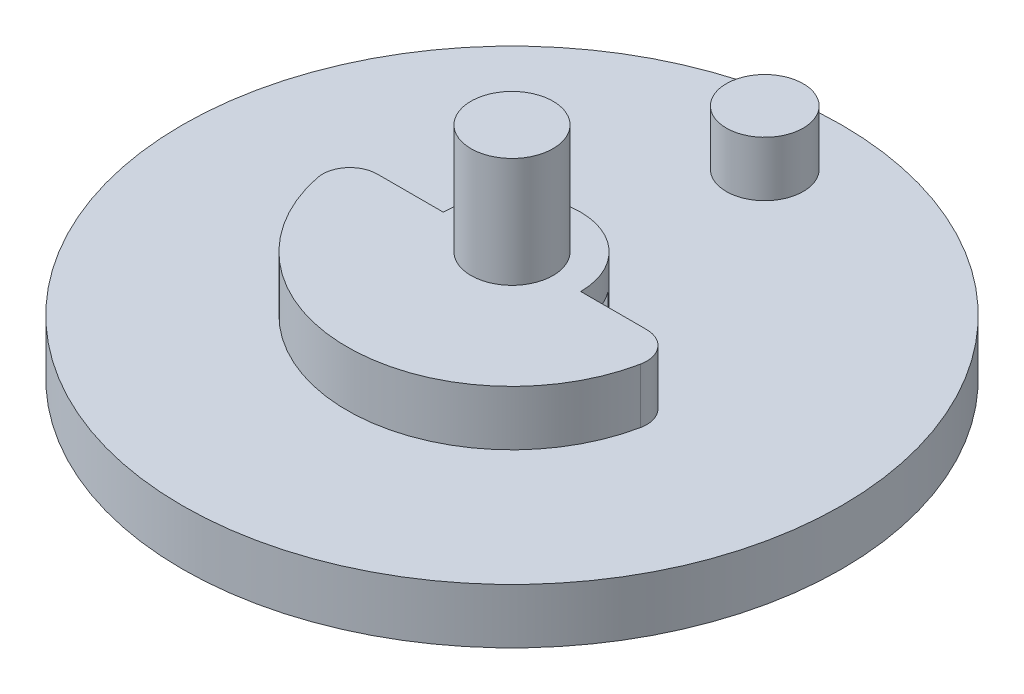
ISO-10303-21;
HEADER;
FILE_DESCRIPTION(('STEP AP214'),'2;1');
FILE_NAME('part.step','',(''),(''),'','','');
FILE_SCHEMA(('AUTOMOTIVE_DESIGN { 1 0 10303 214 1 1 1 1 }'));
ENDSEC;
DATA;
#1=APPLICATION_CONTEXT('core data for automotive mechanical design processes');
#2=APPLICATION_PROTOCOL_DEFINITION('international standard','automotive_design',2000,#1);
#3=PRODUCT_CONTEXT('',#1,'mechanical');
#4=PRODUCT('Part','Part','',(#3));
#5=PRODUCT_RELATED_PRODUCT_CATEGORY('part','',(#4));
#6=PRODUCT_DEFINITION_FORMATION('','',#4);
#7=PRODUCT_DEFINITION_CONTEXT('part definition',#1,'design');
#8=PRODUCT_DEFINITION('design','',#6,#7);
#9=PRODUCT_DEFINITION_SHAPE('','',#8);
#10=(LENGTH_UNIT() NAMED_UNIT(*) SI_UNIT(.MILLI.,.METRE.));
#11=(NAMED_UNIT(*) PLANE_ANGLE_UNIT() SI_UNIT($,.RADIAN.));
#12=(NAMED_UNIT(*) SI_UNIT($,.STERADIAN.) SOLID_ANGLE_UNIT());
#13=UNCERTAINTY_MEASURE_WITH_UNIT(LENGTH_MEASURE(1.E-05),#10,'distance_accuracy_value','');
#14=(GEOMETRIC_REPRESENTATION_CONTEXT(3) GLOBAL_UNCERTAINTY_ASSIGNED_CONTEXT((#13)) GLOBAL_UNIT_ASSIGNED_CONTEXT((#10,
#11,#12)) REPRESENTATION_CONTEXT('',''));
#15=CARTESIAN_POINT('',(0.,0.,0.));
#16=DIRECTION('',(0.,0.,1.));
#17=DIRECTION('',(1.,0.,0.));
#18=AXIS2_PLACEMENT_3D('',#15,#16,#17);
#19=CARTESIAN_POINT('',(0.,-5.,0.));
#20=DIRECTION('',(0.,1.,0.));
#21=DIRECTION('',(0.,0.,1.));
#22=AXIS2_PLACEMENT_3D('',#19,#20,#21);
#23=CYLINDRICAL_SURFACE('',#22,4.);
#24=CARTESIAN_POINT('',(0.,0.,0.));
#25=DIRECTION('',(0.,-1.,0.));
#26=DIRECTION('',(0.,0.,-1.));
#27=AXIS2_PLACEMENT_3D('',#24,#25,#26);
#28=CIRCLE('',#27,4.);
#29=CARTESIAN_POINT('',(0.,0.,-4.));
#30=VERTEX_POINT('',#29);
#31=EDGE_CURVE('E239',#30,#30,#28,.T.);
#32=ORIENTED_EDGE('',*,*,#31,.T.);
#33=EDGE_LOOP('',(#32));
#34=FACE_BOUND('',#33,.T.);
#35=CARTESIAN_POINT('',(0.,-2.5,0.));
#36=DIRECTION('',(0.,-1.,0.));
#37=DIRECTION('',(0.,0.,-1.));
#38=AXIS2_PLACEMENT_3D('',#35,#36,#37);
#39=CIRCLE('',#38,4.);
#40=CARTESIAN_POINT('',(0.,-2.5,-4.));
#41=VERTEX_POINT('',#40);
#42=EDGE_CURVE('E207',#41,#41,#39,.T.);
#43=ORIENTED_EDGE('',*,*,#42,.F.);
#44=EDGE_LOOP('',(#43));
#45=FACE_BOUND('',#44,.T.);
#46=ADVANCED_FACE('F40',(#34,#45),#23,.T.);
#47=CARTESIAN_POINT('',(0.,2.,0.));
#48=DIRECTION('',(0.,1.,0.));
#49=DIRECTION('',(0.,0.,1.));
#50=AXIS2_PLACEMENT_3D('',#47,#48,#49);
#51=PLANE('',#50);
#52=DIRECTION('',(-1.,0.,0.));
#53=VECTOR('',#52,1.);
#54=CARTESIAN_POINT('',(-6.,2.,0.));
#55=LINE('',#54,#53);
#56=CARTESIAN_POINT('',(-2.5,2.,0.));
#57=VERTEX_POINT('',#56);
#58=CARTESIAN_POINT('',(-4.89897948556636,2.,0.));
#59=VERTEX_POINT('',#58);
#60=EDGE_CURVE('E275',#57,#59,#55,.T.);
#61=ORIENTED_EDGE('',*,*,#60,.F.);
#62=CARTESIAN_POINT('',(0.,2.,0.));
#63=DIRECTION('',(0.,1.,0.));
#64=DIRECTION('',(0.,0.,1.));
#65=AXIS2_PLACEMENT_3D('',#62,#63,#64);
#66=CIRCLE('',#65,2.5);
#67=CARTESIAN_POINT('',(-2.,2.,-1.5));
#68=VERTEX_POINT('',#67);
#69=EDGE_CURVE('E182',#68,#57,#66,.T.);
#70=ORIENTED_EDGE('',*,*,#69,.F.);
#71=CARTESIAN_POINT('',(2.,2.,-1.5));
#72=VERTEX_POINT('',#71);
#73=EDGE_CURVE('E55',#72,#68,#66,.T.);
#74=ORIENTED_EDGE('',*,*,#73,.F.);
#75=CARTESIAN_POINT('',(2.5,2.,0.));
#76=VERTEX_POINT('',#75);
#77=EDGE_CURVE('E179',#76,#72,#66,.T.);
#78=ORIENTED_EDGE('',*,*,#77,.F.);
#79=CARTESIAN_POINT('',(4.89897948556635,2.,0.));
#80=VERTEX_POINT('',#79);
#81=EDGE_CURVE('E270',#80,#76,#55,.T.);
#82=ORIENTED_EDGE('',*,*,#81,.F.);
#83=CARTESIAN_POINT('',(4.89897948556636,2.,1.));
#84=DIRECTION('',(0.,1.,0.));
#85=DIRECTION('',(0.,0.,1.));
#86=AXIS2_PLACEMENT_3D('',#83,#84,#85);
#87=CIRCLE('',#86,1.);
#88=CARTESIAN_POINT('',(5.87877538267963,2.,1.2));
#89=VERTEX_POINT('',#88);
#90=EDGE_CURVE('E295',#80,#89,#87,.F.);
#91=ORIENTED_EDGE('',*,*,#90,.T.);
#92=CARTESIAN_POINT('',(0.,2.,0.));
#93=DIRECTION('',(0.,1.,0.));
#94=DIRECTION('',(0.,0.,1.));
#95=AXIS2_PLACEMENT_3D('',#92,#93,#94);
#96=CIRCLE('',#95,6.);
#97=CARTESIAN_POINT('',(-5.87877538267963,2.,1.2));
#98=VERTEX_POINT('',#97);
#99=EDGE_CURVE('E266',#98,#89,#96,.T.);
#100=ORIENTED_EDGE('',*,*,#99,.F.);
#101=CARTESIAN_POINT('',(-4.89897948556636,2.,1.));
#102=DIRECTION('',(0.,1.,0.));
#103=DIRECTION('',(0.,0.,1.));
#104=AXIS2_PLACEMENT_3D('',#101,#102,#103);
#105=CIRCLE('',#104,1.);
#106=EDGE_CURVE('E242',#98,#59,#105,.F.);
#107=ORIENTED_EDGE('',*,*,#106,.T.);
#108=EDGE_LOOP('',(#61,#70,#74,#78,#82,#91,#100,#107));
#109=FACE_BOUND('',#108,.T.);
#110=CARTESIAN_POINT('',(0.,2.,0.));
#111=DIRECTION('',(0.,1.,0.));
#112=DIRECTION('',(0.,0.,1.));
#113=AXIS2_PLACEMENT_3D('',#110,#111,#112);
#114=CIRCLE('',#113,12.);
#115=CARTESIAN_POINT('',(0.,2.,12.));
#116=VERTEX_POINT('',#115);
#117=EDGE_CURVE('E277',#116,#116,#114,.T.);
#118=ORIENTED_EDGE('',*,*,#117,.T.);
#119=EDGE_LOOP('',(#118));
#120=FACE_BOUND('',#119,.T.);
#121=CARTESIAN_POINT('',(0.,2.,-9.2));
#122=DIRECTION('',(0.,1.,0.));
#123=DIRECTION('',(0.,0.,1.));
#124=AXIS2_PLACEMENT_3D('',#121,#122,#123);
#125=CIRCLE('',#124,1.4);
#126=CARTESIAN_POINT('',(0.,2.,-7.8));
#127=VERTEX_POINT('',#126);
#128=EDGE_CURVE('E262',#127,#127,#125,.T.);
#129=ORIENTED_EDGE('',*,*,#128,.F.);
#130=EDGE_LOOP('',(#129));
#131=FACE_BOUND('',#130,.T.);
#132=ADVANCED_FACE('F317',(#109,#120,#131),#51,.T.);
#133=CARTESIAN_POINT('',(-6.,4.,0.));
#134=DIRECTION('',(0.,0.,1.));
#135=DIRECTION('',(1.,0.,0.));
#136=AXIS2_PLACEMENT_3D('',#133,#134,#135);
#137=PLANE('',#136);
#138=ORIENTED_EDGE('',*,*,#60,.T.);
#139=DIRECTION('',(0.,-1.,0.));
#140=VECTOR('',#139,1.);
#141=CARTESIAN_POINT('',(-4.89897948556636,4.,0.));
#142=LINE('',#141,#140);
#143=CARTESIAN_POINT('',(-4.89897948556636,4.,0.));
#144=VERTEX_POINT('',#143);
#145=EDGE_CURVE('E158',#59,#144,#142,.F.);
#146=ORIENTED_EDGE('',*,*,#145,.T.);
#147=DIRECTION('',(-1.,0.,0.));
#148=VECTOR('',#147,1.);
#149=CARTESIAN_POINT('',(-6.,4.,0.));
#150=LINE('',#149,#148);
#151=CARTESIAN_POINT('',(-2.5,4.,0.));
#152=VERTEX_POINT('',#151);
#153=EDGE_CURVE('E150',#152,#144,#150,.T.);
#154=ORIENTED_EDGE('',*,*,#153,.F.);
#155=DIRECTION('',(0.,1.,0.));
#156=VECTOR('',#155,1.);
#157=CARTESIAN_POINT('',(-2.5,-10.0981376159078,0.));
#158=LINE('',#157,#156);
#159=CARTESIAN_POINT('',(-2.5,3.,0.));
#160=VERTEX_POINT('',#159);
#161=EDGE_CURVE('E155',#160,#152,#158,.T.);
#162=ORIENTED_EDGE('',*,*,#161,.F.);
#163=EDGE_CURVE('E170',#57,#160,#158,.T.);
#164=ORIENTED_EDGE('',*,*,#163,.F.);
#165=EDGE_LOOP('',(#138,#146,#154,#162,#164));
#166=FACE_BOUND('',#165,.T.);
#167=ADVANCED_FACE('F153',(#166),#137,.F.);
#168=CARTESIAN_POINT('',(4.89897948556635,4.,0.));
#169=VERTEX_POINT('',#168);
#170=CARTESIAN_POINT('',(2.5,4.,0.));
#171=VERTEX_POINT('',#170);
#172=EDGE_CURVE('E162',#169,#171,#150,.T.);
#173=ORIENTED_EDGE('',*,*,#172,.F.);
#174=DIRECTION('',(0.,-1.,0.));
#175=VECTOR('',#174,1.);
#176=CARTESIAN_POINT('',(4.89897948556636,4.,0.));
#177=LINE('',#176,#175);
#178=EDGE_CURVE('E280',#169,#80,#177,.T.);
#179=ORIENTED_EDGE('',*,*,#178,.T.);
#180=ORIENTED_EDGE('',*,*,#81,.T.);
#181=DIRECTION('',(0.,1.,0.));
#182=VECTOR('',#181,1.);
#183=CARTESIAN_POINT('',(2.5,-10.0981376159078,0.));
#184=LINE('',#183,#182);
#185=CARTESIAN_POINT('',(2.5,3.,0.));
#186=VERTEX_POINT('',#185);
#187=EDGE_CURVE('E180',#76,#186,#184,.T.);
#188=ORIENTED_EDGE('',*,*,#187,.T.);
#189=EDGE_CURVE('E183',#186,#171,#184,.T.);
#190=ORIENTED_EDGE('',*,*,#189,.T.);
#191=EDGE_LOOP('',(#173,#179,#180,#188,#190));
#192=FACE_BOUND('',#191,.T.);
#193=ADVANCED_FACE('F365',(#192),#137,.F.);
#194=CARTESIAN_POINT('',(0.,2.,0.));
#195=DIRECTION('',(0.,-1.,0.));
#196=DIRECTION('',(0.,0.,-1.));
#197=AXIS2_PLACEMENT_3D('',#194,#195,#196);
#198=CYLINDRICAL_SURFACE('',#197,12.);
#199=ORIENTED_EDGE('',*,*,#117,.F.);
#200=EDGE_LOOP('',(#199));
#201=FACE_BOUND('',#200,.T.);
#202=CARTESIAN_POINT('',(0.,0.,0.));
#203=DIRECTION('',(0.,1.,0.));
#204=DIRECTION('',(0.,0.,1.));
#205=AXIS2_PLACEMENT_3D('',#202,#203,#204);
#206=CIRCLE('',#205,12.);
#207=CARTESIAN_POINT('',(0.,0.,12.));
#208=VERTEX_POINT('',#207);
#209=EDGE_CURVE('E272',#208,#208,#206,.T.);
#210=ORIENTED_EDGE('',*,*,#209,.T.);
#211=EDGE_LOOP('',(#210));
#212=FACE_BOUND('',#211,.T.);
#213=ADVANCED_FACE('F372',(#201,#212),#198,.T.);
#214=CARTESIAN_POINT('',(0.,0.,0.));
#215=DIRECTION('',(0.,1.,0.));
#216=DIRECTION('',(0.,0.,1.));
#217=AXIS2_PLACEMENT_3D('',#214,#215,#216);
#218=PLANE('',#217);
#219=ORIENTED_EDGE('',*,*,#31,.F.);
#220=EDGE_LOOP('',(#219));
#221=FACE_BOUND('',#220,.T.);
#222=ORIENTED_EDGE('',*,*,#209,.F.);
#223=EDGE_LOOP('',(#222));
#224=FACE_BOUND('',#223,.T.);
#225=ADVANCED_FACE('F367',(#221,#224),#218,.F.);
#226=CARTESIAN_POINT('',(0.,4.,0.));
#227=DIRECTION('',(0.,-1.,0.));
#228=DIRECTION('',(0.,0.,-1.));
#229=AXIS2_PLACEMENT_3D('',#226,#227,#228);
#230=CYLINDRICAL_SURFACE('',#229,6.);
#231=ORIENTED_EDGE('',*,*,#99,.T.);
#232=DIRECTION('',(0.,-1.,0.));
#233=VECTOR('',#232,1.);
#234=CARTESIAN_POINT('',(5.87877538267963,4.,1.2));
#235=LINE('',#234,#233);
#236=CARTESIAN_POINT('',(5.87877538267963,4.,1.2));
#237=VERTEX_POINT('',#236);
#238=EDGE_CURVE('E288',#89,#237,#235,.F.);
#239=ORIENTED_EDGE('',*,*,#238,.T.);
#240=CARTESIAN_POINT('',(0.,4.,0.));
#241=DIRECTION('',(0.,1.,0.));
#242=DIRECTION('',(0.,0.,1.));
#243=AXIS2_PLACEMENT_3D('',#240,#241,#242);
#244=CIRCLE('',#243,6.);
#245=CARTESIAN_POINT('',(-5.87877538267963,4.,1.2));
#246=VERTEX_POINT('',#245);
#247=EDGE_CURVE('E163',#246,#237,#244,.T.);
#248=ORIENTED_EDGE('',*,*,#247,.F.);
#249=DIRECTION('',(0.,-1.,0.));
#250=VECTOR('',#249,1.);
#251=CARTESIAN_POINT('',(-5.87877538267963,4.,1.2));
#252=LINE('',#251,#250);
#253=EDGE_CURVE('E285',#246,#98,#252,.T.);
#254=ORIENTED_EDGE('',*,*,#253,.T.);
#255=EDGE_LOOP('',(#231,#239,#248,#254));
#256=FACE_BOUND('',#255,.T.);
#257=ADVANCED_FACE('F362',(#256),#230,.T.);
#258=CARTESIAN_POINT('',(0.,4.,0.));
#259=DIRECTION('',(0.,1.,0.));
#260=DIRECTION('',(0.,0.,1.));
#261=AXIS2_PLACEMENT_3D('',#258,#259,#260);
#262=PLANE('',#261);
#263=ORIENTED_EDGE('',*,*,#172,.T.);
#264=CARTESIAN_POINT('',(0.,4.,0.));
#265=DIRECTION('',(0.,-1.,0.));
#266=DIRECTION('',(0.,0.,1.));
#267=AXIS2_PLACEMENT_3D('',#264,#265,#266);
#268=CIRCLE('',#267,2.5);
#269=EDGE_CURVE('E167',#152,#171,#268,.T.);
#270=ORIENTED_EDGE('',*,*,#269,.F.);
#271=ORIENTED_EDGE('',*,*,#153,.T.);
#272=CARTESIAN_POINT('',(-4.89897948556636,4.,1.));
#273=DIRECTION('',(0.,1.,0.));
#274=DIRECTION('',(0.,0.,1.));
#275=AXIS2_PLACEMENT_3D('',#272,#273,#274);
#276=CIRCLE('',#275,1.);
#277=EDGE_CURVE('E290',#144,#246,#276,.T.);
#278=ORIENTED_EDGE('',*,*,#277,.T.);
#279=ORIENTED_EDGE('',*,*,#247,.T.);
#280=CARTESIAN_POINT('',(4.89897948556636,4.,1.));
#281=DIRECTION('',(0.,1.,0.));
#282=DIRECTION('',(0.,0.,1.));
#283=AXIS2_PLACEMENT_3D('',#280,#281,#282);
#284=CIRCLE('',#283,1.);
#285=EDGE_CURVE('E292',#237,#169,#284,.T.);
#286=ORIENTED_EDGE('',*,*,#285,.T.);
#287=EDGE_LOOP('',(#263,#270,#271,#278,#279,#286));
#288=FACE_BOUND('',#287,.T.);
#289=CARTESIAN_POINT('',(0.,4.,0.));
#290=DIRECTION('',(0.,1.,0.));
#291=DIRECTION('',(0.,0.,1.));
#292=AXIS2_PLACEMENT_3D('',#289,#290,#291);
#293=CIRCLE('',#292,1.495);
#294=CARTESIAN_POINT('',(0.,4.,1.495));
#295=VERTEX_POINT('',#294);
#296=EDGE_CURVE('E48',#295,#295,#293,.F.);
#297=ORIENTED_EDGE('',*,*,#296,.T.);
#298=EDGE_LOOP('',(#297));
#299=FACE_BOUND('',#298,.T.);
#300=ADVANCED_FACE('F172',(#288,#299),#262,.T.);
#301=CARTESIAN_POINT('',(0.,4.,-9.2));
#302=DIRECTION('',(0.,-1.,0.));
#303=DIRECTION('',(0.,0.,-1.));
#304=AXIS2_PLACEMENT_3D('',#301,#302,#303);
#305=CYLINDRICAL_SURFACE('',#304,1.4);
#306=CARTESIAN_POINT('',(0.,4.,-9.2));
#307=DIRECTION('',(0.,1.,0.));
#308=DIRECTION('',(0.,0.,1.));
#309=AXIS2_PLACEMENT_3D('',#306,#307,#308);
#310=CIRCLE('',#309,1.4);
#311=CARTESIAN_POINT('',(0.,4.,-7.8));
#312=VERTEX_POINT('',#311);
#313=EDGE_CURVE('E263',#312,#312,#310,.T.);
#314=ORIENTED_EDGE('',*,*,#313,.F.);
#315=EDGE_LOOP('',(#314));
#316=FACE_BOUND('',#315,.T.);
#317=ORIENTED_EDGE('',*,*,#128,.T.);
#318=EDGE_LOOP('',(#317));
#319=FACE_BOUND('',#318,.T.);
#320=ADVANCED_FACE('F355',(#316,#319),#305,.T.);
#321=CARTESIAN_POINT('',(0.,4.,-9.2));
#322=DIRECTION('',(0.,1.,0.));
#323=DIRECTION('',(0.,0.,1.));
#324=AXIS2_PLACEMENT_3D('',#321,#322,#323);
#325=PLANE('',#324);
#326=ORIENTED_EDGE('',*,*,#313,.T.);
#327=EDGE_LOOP('',(#326));
#328=FACE_BOUND('',#327,.T.);
#329=ADVANCED_FACE('F352',(#328),#325,.T.);
#330=CARTESIAN_POINT('',(4.89897948556636,4.,1.));
#331=DIRECTION('',(0.,-1.,0.));
#332=DIRECTION('',(0.,0.,-1.));
#333=AXIS2_PLACEMENT_3D('',#330,#331,#332);
#334=CYLINDRICAL_SURFACE('',#333,1.);
#335=ORIENTED_EDGE('',*,*,#285,.F.);
#336=ORIENTED_EDGE('',*,*,#238,.F.);
#337=ORIENTED_EDGE('',*,*,#90,.F.);
#338=ORIENTED_EDGE('',*,*,#178,.F.);
#339=EDGE_LOOP('',(#335,#336,#337,#338));
#340=FACE_BOUND('',#339,.T.);
#341=ADVANCED_FACE('F313',(#340),#334,.T.);
#342=CARTESIAN_POINT('',(-4.89897948556636,4.,1.));
#343=DIRECTION('',(0.,-1.,0.));
#344=DIRECTION('',(0.,0.,-1.));
#345=AXIS2_PLACEMENT_3D('',#342,#343,#344);
#346=CYLINDRICAL_SURFACE('',#345,1.);
#347=ORIENTED_EDGE('',*,*,#277,.F.);
#348=ORIENTED_EDGE('',*,*,#145,.F.);
#349=ORIENTED_EDGE('',*,*,#106,.F.);
#350=ORIENTED_EDGE('',*,*,#253,.F.);
#351=EDGE_LOOP('',(#347,#348,#349,#350));
#352=FACE_BOUND('',#351,.T.);
#353=ADVANCED_FACE('F42',(#352),#346,.T.);
#354=CARTESIAN_POINT('',(0.,8.,0.));
#355=DIRECTION('',(0.,1.,0.));
#356=DIRECTION('',(0.,0.,1.));
#357=AXIS2_PLACEMENT_3D('',#354,#355,#356);
#358=PLANE('',#357);
#359=CARTESIAN_POINT('',(0.,8.,0.));
#360=DIRECTION('',(0.,1.,0.));
#361=DIRECTION('',(0.,0.,1.));
#362=AXIS2_PLACEMENT_3D('',#359,#360,#361);
#363=CIRCLE('',#362,1.495);
#364=CARTESIAN_POINT('',(0.,8.,1.495));
#365=VERTEX_POINT('',#364);
#366=EDGE_CURVE('E235',#365,#365,#363,.T.);
#367=ORIENTED_EDGE('',*,*,#366,.T.);
#368=EDGE_LOOP('',(#367));
#369=FACE_BOUND('',#368,.T.);
#370=ADVANCED_FACE('F304',(#369),#358,.T.);
#371=CARTESIAN_POINT('',(0.,-2.5254833995939,0.));
#372=DIRECTION('',(0.,1.,0.));
#373=DIRECTION('',(0.,0.,1.));
#374=AXIS2_PLACEMENT_3D('',#371,#372,#373);
#375=CYLINDRICAL_SURFACE('',#374,1.495);
#376=ORIENTED_EDGE('',*,*,#296,.F.);
#377=EDGE_LOOP('',(#376));
#378=FACE_BOUND('',#377,.T.);
#379=ORIENTED_EDGE('',*,*,#366,.F.);
#380=EDGE_LOOP('',(#379));
#381=FACE_BOUND('',#380,.T.);
#382=ADVANCED_FACE('F300',(#378,#381),#375,.T.);
#383=CARTESIAN_POINT('',(0.,-2.5,0.));
#384=DIRECTION('',(0.,-1.,0.));
#385=DIRECTION('',(0.,0.,-1.));
#386=AXIS2_PLACEMENT_3D('',#383,#384,#385);
#387=PLANE('',#386);
#388=CARTESIAN_POINT('',(0.,-2.5,0.));
#389=DIRECTION('',(0.,-1.,0.));
#390=DIRECTION('',(0.,0.,-1.));
#391=AXIS2_PLACEMENT_3D('',#388,#389,#390);
#392=CIRCLE('',#391,1.6);
#393=CARTESIAN_POINT('',(0.556776436283001,-2.5,-1.5));
#394=VERTEX_POINT('',#393);
#395=CARTESIAN_POINT('',(-0.556776436283001,-2.5,-1.5));
#396=VERTEX_POINT('',#395);
#397=EDGE_CURVE('E205',#394,#396,#392,.F.);
#398=ORIENTED_EDGE('',*,*,#397,.T.);
#399=DIRECTION('',(1.,0.,0.));
#400=VECTOR('',#399,1.);
#401=CARTESIAN_POINT('',(0.,-2.5,-1.5));
#402=LINE('',#401,#400);
#403=CARTESIAN_POINT('',(-2.,-2.5,-1.5));
#404=VERTEX_POINT('',#403);
#405=EDGE_CURVE('E202',#404,#396,#402,.T.);
#406=ORIENTED_EDGE('',*,*,#405,.F.);
#407=CARTESIAN_POINT('',(0.,-2.5,0.));
#408=DIRECTION('',(0.,-1.,0.));
#409=DIRECTION('',(0.,0.,-1.));
#410=AXIS2_PLACEMENT_3D('',#407,#408,#409);
#411=CIRCLE('',#410,2.5);
#412=CARTESIAN_POINT('',(-2.,-2.5,1.5));
#413=VERTEX_POINT('',#412);
#414=EDGE_CURVE('E199',#413,#404,#411,.T.);
#415=ORIENTED_EDGE('',*,*,#414,.F.);
#416=DIRECTION('',(-1.,0.,0.));
#417=VECTOR('',#416,1.);
#418=CARTESIAN_POINT('',(0.,-2.5,1.5));
#419=LINE('',#418,#417);
#420=CARTESIAN_POINT('',(-0.556776436283002,-2.5,1.5));
#421=VERTEX_POINT('',#420);
#422=EDGE_CURVE('E196',#421,#413,#419,.T.);
#423=ORIENTED_EDGE('',*,*,#422,.F.);
#424=CARTESIAN_POINT('',(0.,-2.5,0.));
#425=DIRECTION('',(0.,-1.,0.));
#426=DIRECTION('',(0.,0.,-1.));
#427=AXIS2_PLACEMENT_3D('',#424,#425,#426);
#428=CIRCLE('',#427,1.6);
#429=CARTESIAN_POINT('',(0.556776436283002,-2.5,1.5));
#430=VERTEX_POINT('',#429);
#431=EDGE_CURVE('E186',#421,#430,#428,.F.);
#432=ORIENTED_EDGE('',*,*,#431,.T.);
#433=DIRECTION('',(1.,0.,0.));
#434=VECTOR('',#433,1.);
#435=CARTESIAN_POINT('',(0.,-2.5,1.5));
#436=LINE('',#435,#434);
#437=CARTESIAN_POINT('',(2.,-2.5,1.5));
#438=VERTEX_POINT('',#437);
#439=EDGE_CURVE('E11',#430,#438,#436,.T.);
#440=ORIENTED_EDGE('',*,*,#439,.T.);
#441=CARTESIAN_POINT('',(0.,-2.5,0.));
#442=DIRECTION('',(0.,-1.,0.));
#443=DIRECTION('',(0.,0.,-1.));
#444=AXIS2_PLACEMENT_3D('',#441,#442,#443);
#445=CIRCLE('',#444,2.5);
#446=CARTESIAN_POINT('',(2.,-2.5,-1.5));
#447=VERTEX_POINT('',#446);
#448=EDGE_CURVE('E190',#447,#438,#445,.T.);
#449=ORIENTED_EDGE('',*,*,#448,.F.);
#450=DIRECTION('',(1.,0.,0.));
#451=VECTOR('',#450,1.);
#452=CARTESIAN_POINT('',(0.,-2.5,-1.5));
#453=LINE('',#452,#451);
#454=EDGE_CURVE('E193',#394,#447,#453,.T.);
#455=ORIENTED_EDGE('',*,*,#454,.F.);
#456=EDGE_LOOP('',(#398,#406,#415,#423,#432,#440,#449,#455));
#457=FACE_BOUND('',#456,.T.);
#458=ORIENTED_EDGE('',*,*,#42,.T.);
#459=EDGE_LOOP('',(#458));
#460=FACE_BOUND('',#459,.T.);
#461=ADVANCED_FACE('F303',(#457,#460),#387,.T.);
#462=CARTESIAN_POINT('',(0.,3.,0.));
#463=DIRECTION('',(0.,-1.,0.));
#464=DIRECTION('',(0.,0.,-1.));
#465=AXIS2_PLACEMENT_3D('',#462,#463,#464);
#466=PLANE('',#465);
#467=CARTESIAN_POINT('',(0.,3.,0.));
#468=DIRECTION('',(0.,-1.,0.));
#469=DIRECTION('',(0.,0.,-1.));
#470=AXIS2_PLACEMENT_3D('',#467,#468,#469);
#471=CIRCLE('',#470,2.50000000000001);
#472=CARTESIAN_POINT('',(-2.,3.,1.5));
#473=VERTEX_POINT('',#472);
#474=EDGE_CURVE('E210',#473,#160,#471,.T.);
#475=ORIENTED_EDGE('',*,*,#474,.T.);
#476=CARTESIAN_POINT('',(0.,3.,0.));
#477=DIRECTION('',(0.,-1.,0.));
#478=DIRECTION('',(0.,0.,-1.));
#479=AXIS2_PLACEMENT_3D('',#476,#477,#478);
#480=CIRCLE('',#479,2.5);
#481=CARTESIAN_POINT('',(-2.,3.,-1.5));
#482=VERTEX_POINT('',#481);
#483=EDGE_CURVE('E169',#482,#160,#480,.F.);
#484=ORIENTED_EDGE('',*,*,#483,.F.);
#485=DIRECTION('',(1.,0.,0.));
#486=VECTOR('',#485,1.);
#487=CARTESIAN_POINT('',(-0.556776436283001,3.,-1.5));
#488=LINE('',#487,#486);
#489=CARTESIAN_POINT('',(-0.556776436283002,3.,-1.5));
#490=VERTEX_POINT('',#489);
#491=EDGE_CURVE('E213',#482,#490,#488,.T.);
#492=ORIENTED_EDGE('',*,*,#491,.T.);
#493=CARTESIAN_POINT('',(0.,3.,0.));
#494=DIRECTION('',(0.,-1.,0.));
#495=DIRECTION('',(0.,0.,-1.));
#496=AXIS2_PLACEMENT_3D('',#493,#494,#495);
#497=CIRCLE('',#496,1.6);
#498=CARTESIAN_POINT('',(0.556776436283001,3.,-1.5));
#499=VERTEX_POINT('',#498);
#500=EDGE_CURVE('E216',#490,#499,#497,.T.);
#501=ORIENTED_EDGE('',*,*,#500,.T.);
#502=DIRECTION('',(1.,0.,0.));
#503=VECTOR('',#502,1.);
#504=CARTESIAN_POINT('',(2.,3.,-1.5));
#505=LINE('',#504,#503);
#506=CARTESIAN_POINT('',(2.,3.,-1.5));
#507=VERTEX_POINT('',#506);
#508=EDGE_CURVE('E219',#499,#507,#505,.T.);
#509=ORIENTED_EDGE('',*,*,#508,.T.);
#510=CARTESIAN_POINT('',(0.,3.,0.));
#511=DIRECTION('',(0.,-1.,0.));
#512=DIRECTION('',(0.,0.,1.));
#513=AXIS2_PLACEMENT_3D('',#510,#511,#512);
#514=CIRCLE('',#513,2.5);
#515=EDGE_CURVE('E223',#507,#186,#514,.T.);
#516=ORIENTED_EDGE('',*,*,#515,.T.);
#517=CARTESIAN_POINT('',(2.,3.,1.5));
#518=VERTEX_POINT('',#517);
#519=EDGE_CURVE('E222',#186,#518,#514,.T.);
#520=ORIENTED_EDGE('',*,*,#519,.T.);
#521=DIRECTION('',(-1.,0.,0.));
#522=VECTOR('',#521,1.);
#523=CARTESIAN_POINT('',(0.556776436283002,3.,1.5));
#524=LINE('',#523,#522);
#525=CARTESIAN_POINT('',(0.556776436283002,3.,1.5));
#526=VERTEX_POINT('',#525);
#527=EDGE_CURVE('E226',#518,#526,#524,.T.);
#528=ORIENTED_EDGE('',*,*,#527,.T.);
#529=CARTESIAN_POINT('',(0.,3.,0.));
#530=DIRECTION('',(0.,-1.,0.));
#531=DIRECTION('',(0.,0.,1.));
#532=AXIS2_PLACEMENT_3D('',#529,#530,#531);
#533=CIRCLE('',#532,1.60000000000002);
#534=CARTESIAN_POINT('',(-0.556776436283002,3.,1.5));
#535=VERTEX_POINT('',#534);
#536=EDGE_CURVE('E229',#526,#535,#533,.T.);
#537=ORIENTED_EDGE('',*,*,#536,.T.);
#538=DIRECTION('',(-1.,0.,0.));
#539=VECTOR('',#538,1.);
#540=CARTESIAN_POINT('',(-2.,3.,1.5));
#541=LINE('',#540,#539);
#542=EDGE_CURVE('E232',#535,#473,#541,.T.);
#543=ORIENTED_EDGE('',*,*,#542,.T.);
#544=EDGE_LOOP('',(#475,#484,#492,#501,#509,#516,#520,#528,#537,#543));
#545=FACE_BOUND('',#544,.T.);
#546=ADVANCED_FACE('F329',(#545),#466,.T.);
#547=CARTESIAN_POINT('',(0.,-5.,1.5));
#548=DIRECTION('',(0.,0.,1.));
#549=DIRECTION('',(1.,0.,0.));
#550=AXIS2_PLACEMENT_3D('',#547,#548,#549);
#551=PLANE('',#550);
#552=ORIENTED_EDGE('',*,*,#439,.F.);
#553=DIRECTION('',(0.,1.,0.));
#554=VECTOR('',#553,1.);
#555=CARTESIAN_POINT('',(0.556776436283002,-5.,1.5));
#556=LINE('',#555,#554);
#557=EDGE_CURVE('E245',#430,#526,#556,.T.);
#558=ORIENTED_EDGE('',*,*,#557,.T.);
#559=ORIENTED_EDGE('',*,*,#527,.F.);
#560=DIRECTION('',(0.,1.,0.));
#561=VECTOR('',#560,1.);
#562=CARTESIAN_POINT('',(2.,-5.,1.5));
#563=LINE('',#562,#561);
#564=EDGE_CURVE('E238',#438,#518,#563,.T.);
#565=ORIENTED_EDGE('',*,*,#564,.F.);
#566=EDGE_LOOP('',(#552,#558,#559,#565));
#567=FACE_BOUND('',#566,.T.);
#568=ADVANCED_FACE('F325',(#567),#551,.F.);
#569=CARTESIAN_POINT('',(0.,-5.,1.5));
#570=DIRECTION('',(0.,0.,-1.));
#571=DIRECTION('',(-1.,0.,0.));
#572=AXIS2_PLACEMENT_3D('',#569,#570,#571);
#573=PLANE('',#572);
#574=DIRECTION('',(0.,1.,0.));
#575=VECTOR('',#574,1.);
#576=CARTESIAN_POINT('',(-0.556776436283002,-5.,1.5));
#577=LINE('',#576,#575);
#578=EDGE_CURVE('E247',#421,#535,#577,.T.);
#579=ORIENTED_EDGE('',*,*,#578,.F.);
#580=ORIENTED_EDGE('',*,*,#422,.T.);
#581=DIRECTION('',(0.,1.,0.));
#582=VECTOR('',#581,1.);
#583=CARTESIAN_POINT('',(-2.,-5.,1.5));
#584=LINE('',#583,#582);
#585=EDGE_CURVE('E249',#413,#473,#584,.T.);
#586=ORIENTED_EDGE('',*,*,#585,.T.);
#587=ORIENTED_EDGE('',*,*,#542,.F.);
#588=EDGE_LOOP('',(#579,#580,#586,#587));
#589=FACE_BOUND('',#588,.T.);
#590=ADVANCED_FACE('F328',(#589),#573,.T.);
#591=CARTESIAN_POINT('',(0.,0.,0.));
#592=DIRECTION('',(0.,1.,0.));
#593=DIRECTION('',(0.,0.,1.));
#594=AXIS2_PLACEMENT_3D('',#591,#592,#593);
#595=CYLINDRICAL_SURFACE('',#594,1.6);
#596=ORIENTED_EDGE('',*,*,#431,.F.);
#597=ORIENTED_EDGE('',*,*,#578,.T.);
#598=ORIENTED_EDGE('',*,*,#536,.F.);
#599=ORIENTED_EDGE('',*,*,#557,.F.);
#600=EDGE_LOOP('',(#596,#597,#598,#599));
#601=FACE_BOUND('',#600,.T.);
#602=ADVANCED_FACE('F333',(#601),#595,.F.);
#603=CARTESIAN_POINT('',(0.,-5.,0.));
#604=DIRECTION('',(0.,1.,0.));
#605=DIRECTION('',(0.,0.,1.));
#606=AXIS2_PLACEMENT_3D('',#603,#604,#605);
#607=CYLINDRICAL_SURFACE('',#606,2.5);
#608=ORIENTED_EDGE('',*,*,#163,.T.);
#609=ORIENTED_EDGE('',*,*,#474,.F.);
#610=ORIENTED_EDGE('',*,*,#585,.F.);
#611=ORIENTED_EDGE('',*,*,#414,.T.);
#612=DIRECTION('',(0.,1.,0.));
#613=VECTOR('',#612,1.);
#614=CARTESIAN_POINT('',(-2.,-5.,-1.5));
#615=LINE('',#614,#613);
#616=EDGE_CURVE('E251',#404,#68,#615,.T.);
#617=ORIENTED_EDGE('',*,*,#616,.T.);
#618=ORIENTED_EDGE('',*,*,#69,.T.);
#619=EDGE_LOOP('',(#608,#609,#610,#611,#617,#618));
#620=FACE_BOUND('',#619,.T.);
#621=ADVANCED_FACE('F335',(#620),#607,.F.);
#622=CARTESIAN_POINT('',(0.,-5.,-1.5));
#623=DIRECTION('',(0.,0.,1.));
#624=DIRECTION('',(1.,0.,0.));
#625=AXIS2_PLACEMENT_3D('',#622,#623,#624);
#626=PLANE('',#625);
#627=ORIENTED_EDGE('',*,*,#616,.F.);
#628=ORIENTED_EDGE('',*,*,#405,.T.);
#629=DIRECTION('',(0.,1.,0.));
#630=VECTOR('',#629,1.);
#631=CARTESIAN_POINT('',(-0.556776436283001,-5.,-1.5));
#632=LINE('',#631,#630);
#633=EDGE_CURVE('E254',#396,#490,#632,.T.);
#634=ORIENTED_EDGE('',*,*,#633,.T.);
#635=ORIENTED_EDGE('',*,*,#491,.F.);
#636=DIRECTION('',(0.,1.,0.));
#637=VECTOR('',#636,1.);
#638=CARTESIAN_POINT('',(-2.,-10.0981376159078,-1.5));
#639=LINE('',#638,#637);
#640=EDGE_CURVE('E187',#68,#482,#639,.T.);
#641=ORIENTED_EDGE('',*,*,#640,.F.);
#642=EDGE_LOOP('',(#627,#628,#634,#635,#641));
#643=FACE_BOUND('',#642,.T.);
#644=ADVANCED_FACE('F338',(#643),#626,.T.);
#645=DIRECTION('',(0.,1.,0.));
#646=VECTOR('',#645,1.);
#647=CARTESIAN_POINT('',(0.556776436283001,-5.,-1.5));
#648=LINE('',#647,#646);
#649=EDGE_CURVE('E256',#394,#499,#648,.T.);
#650=ORIENTED_EDGE('',*,*,#649,.F.);
#651=ORIENTED_EDGE('',*,*,#454,.T.);
#652=DIRECTION('',(0.,1.,0.));
#653=VECTOR('',#652,1.);
#654=CARTESIAN_POINT('',(2.,-5.,-1.5));
#655=LINE('',#654,#653);
#656=EDGE_CURVE('E259',#447,#72,#655,.T.);
#657=ORIENTED_EDGE('',*,*,#656,.T.);
#658=EDGE_CURVE('E258',#72,#507,#655,.T.);
#659=ORIENTED_EDGE('',*,*,#658,.T.);
#660=ORIENTED_EDGE('',*,*,#508,.F.);
#661=EDGE_LOOP('',(#650,#651,#657,#659,#660));
#662=FACE_BOUND('',#661,.T.);
#663=ADVANCED_FACE('F342',(#662),#626,.T.);
#664=ORIENTED_EDGE('',*,*,#397,.F.);
#665=ORIENTED_EDGE('',*,*,#649,.T.);
#666=ORIENTED_EDGE('',*,*,#500,.F.);
#667=ORIENTED_EDGE('',*,*,#633,.F.);
#668=EDGE_LOOP('',(#664,#665,#666,#667));
#669=FACE_BOUND('',#668,.T.);
#670=ADVANCED_FACE('F347',(#669),#595,.F.);
#671=CARTESIAN_POINT('',(0.,-5.,0.));
#672=DIRECTION('',(0.,1.,0.));
#673=DIRECTION('',(0.,0.,1.));
#674=AXIS2_PLACEMENT_3D('',#671,#672,#673);
#675=CYLINDRICAL_SURFACE('',#674,2.5);
#676=ORIENTED_EDGE('',*,*,#187,.F.);
#677=ORIENTED_EDGE('',*,*,#77,.T.);
#678=ORIENTED_EDGE('',*,*,#656,.F.);
#679=ORIENTED_EDGE('',*,*,#448,.T.);
#680=ORIENTED_EDGE('',*,*,#564,.T.);
#681=ORIENTED_EDGE('',*,*,#519,.F.);
#682=EDGE_LOOP('',(#676,#677,#678,#679,#680,#681));
#683=FACE_BOUND('',#682,.T.);
#684=ADVANCED_FACE('F344',(#683),#675,.F.);
#685=CARTESIAN_POINT('',(0.,-10.0981376159078,0.));
#686=DIRECTION('',(0.,1.,0.));
#687=DIRECTION('',(0.,0.,1.));
#688=AXIS2_PLACEMENT_3D('',#685,#686,#687);
#689=CYLINDRICAL_SURFACE('',#688,2.5);
#690=ORIENTED_EDGE('',*,*,#483,.T.);
#691=ORIENTED_EDGE('',*,*,#161,.T.);
#692=ORIENTED_EDGE('',*,*,#269,.T.);
#693=ORIENTED_EDGE('',*,*,#189,.F.);
#694=ORIENTED_EDGE('',*,*,#515,.F.);
#695=ORIENTED_EDGE('',*,*,#658,.F.);
#696=ORIENTED_EDGE('',*,*,#73,.T.);
#697=ORIENTED_EDGE('',*,*,#640,.T.);
#698=EDGE_LOOP('',(#690,#691,#692,#693,#694,#695,#696,#697));
#699=FACE_BOUND('',#698,.T.);
#700=ADVANCED_FACE('F166',(#699),#689,.T.);
#701=CLOSED_SHELL('',(#46,#132,#167,#193,#213,#225,#257,#300,#320,#329,#341,#353,#370,#382,#461,
#546,#568,#590,#602,#621,#644,#663,#670,#684,#700));
#702=MANIFOLD_SOLID_BREP('B2',#701);
#703=ADVANCED_BREP_SHAPE_REPRESENTATION('',(#18,#702),#14);
#704=SHAPE_DEFINITION_REPRESENTATION(#9,#703);
ENDSEC;
END-ISO-10303-21;
